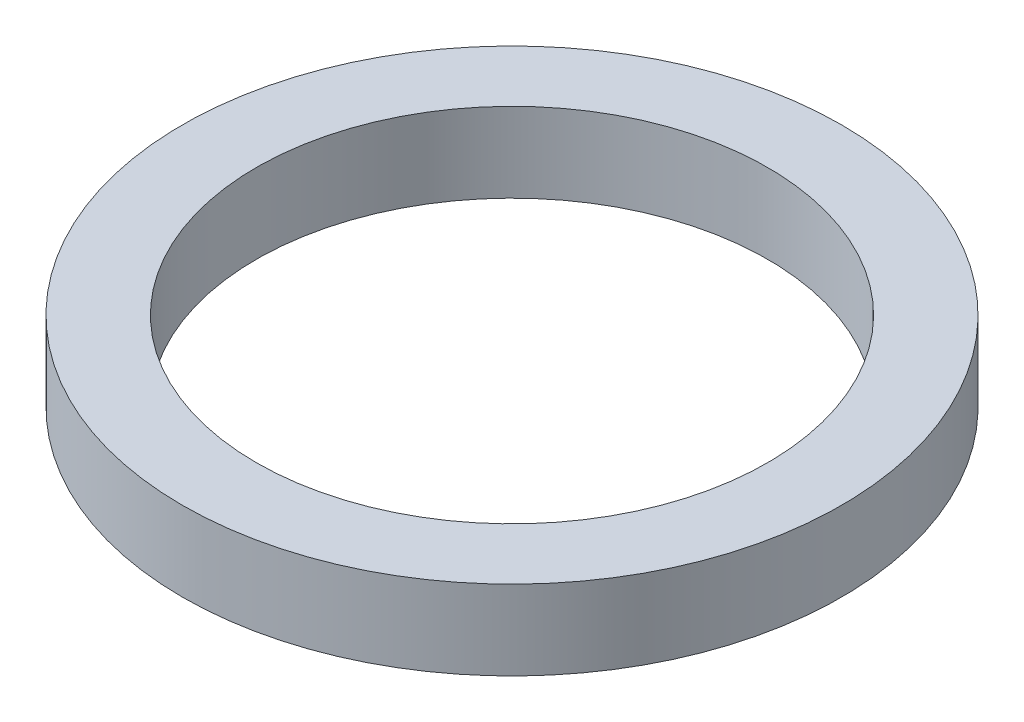
ISO-10303-21;
HEADER;
FILE_DESCRIPTION(('STEP AP214'),'2;1');
FILE_NAME('part.step','',(''),(''),'','','');
FILE_SCHEMA(('AUTOMOTIVE_DESIGN { 1 0 10303 214 1 1 1 1 }'));
ENDSEC;
DATA;
#1=APPLICATION_CONTEXT('core data for automotive mechanical design processes');
#2=APPLICATION_PROTOCOL_DEFINITION('international standard','automotive_design',2000,#1);
#3=PRODUCT_CONTEXT('',#1,'mechanical');
#4=PRODUCT('Part','Part','',(#3));
#5=PRODUCT_RELATED_PRODUCT_CATEGORY('part','',(#4));
#6=PRODUCT_DEFINITION_FORMATION('','',#4);
#7=PRODUCT_DEFINITION_CONTEXT('part definition',#1,'design');
#8=PRODUCT_DEFINITION('design','',#6,#7);
#9=PRODUCT_DEFINITION_SHAPE('','',#8);
#10=(LENGTH_UNIT() NAMED_UNIT(*) SI_UNIT(.MILLI.,.METRE.));
#11=(NAMED_UNIT(*) PLANE_ANGLE_UNIT() SI_UNIT($,.RADIAN.));
#12=(NAMED_UNIT(*) SI_UNIT($,.STERADIAN.) SOLID_ANGLE_UNIT());
#13=UNCERTAINTY_MEASURE_WITH_UNIT(LENGTH_MEASURE(1.E-05),#10,'distance_accuracy_value','');
#14=(GEOMETRIC_REPRESENTATION_CONTEXT(3) GLOBAL_UNCERTAINTY_ASSIGNED_CONTEXT((#13)) GLOBAL_UNIT_ASSIGNED_CONTEXT((#10,
#11,#12)) REPRESENTATION_CONTEXT('',''));
#15=CARTESIAN_POINT('',(0.,0.,0.));
#16=DIRECTION('',(0.,0.,1.));
#17=DIRECTION('',(1.,0.,0.));
#18=AXIS2_PLACEMENT_3D('',#15,#16,#17);
#19=CARTESIAN_POINT('',(0.,7.,0.));
#20=DIRECTION('',(0.,1.,0.));
#21=DIRECTION('',(0.,0.,1.));
#22=AXIS2_PLACEMENT_3D('',#19,#20,#21);
#23=PLANE('',#22);
#24=CARTESIAN_POINT('',(0.,7.,0.));
#25=DIRECTION('',(0.,1.,0.));
#26=DIRECTION('',(0.,0.,1.));
#27=AXIS2_PLACEMENT_3D('',#24,#25,#26);
#28=CIRCLE('',#27,29.);
#29=CARTESIAN_POINT('',(0.,7.,29.));
#30=VERTEX_POINT('',#29);
#31=EDGE_CURVE('E10',#30,#30,#28,.T.);
#32=ORIENTED_EDGE('',*,*,#31,.T.);
#33=EDGE_LOOP('',(#32));
#34=FACE_BOUND('',#33,.T.);
#35=CARTESIAN_POINT('',(0.,7.,0.));
#36=DIRECTION('',(0.,1.,0.));
#37=DIRECTION('',(0.,0.,1.));
#38=AXIS2_PLACEMENT_3D('',#35,#36,#37);
#39=CIRCLE('',#38,22.5);
#40=CARTESIAN_POINT('',(0.,7.,22.5));
#41=VERTEX_POINT('',#40);
#42=EDGE_CURVE('E42',#41,#41,#39,.T.);
#43=ORIENTED_EDGE('',*,*,#42,.F.);
#44=EDGE_LOOP('',(#43));
#45=FACE_BOUND('',#44,.T.);
#46=ADVANCED_FACE('F31',(#34,#45),#23,.T.);
#47=CARTESIAN_POINT('',(0.,0.,0.));
#48=DIRECTION('',(0.,1.,0.));
#49=DIRECTION('',(0.,0.,1.));
#50=AXIS2_PLACEMENT_3D('',#47,#48,#49);
#51=PLANE('',#50);
#52=CARTESIAN_POINT('',(0.,0.,0.));
#53=DIRECTION('',(0.,1.,0.));
#54=DIRECTION('',(0.,0.,1.));
#55=AXIS2_PLACEMENT_3D('',#52,#53,#54);
#56=CIRCLE('',#55,29.);
#57=CARTESIAN_POINT('',(0.,0.,29.));
#58=VERTEX_POINT('',#57);
#59=EDGE_CURVE('E35',#58,#58,#56,.T.);
#60=ORIENTED_EDGE('',*,*,#59,.F.);
#61=EDGE_LOOP('',(#60));
#62=FACE_BOUND('',#61,.T.);
#63=CARTESIAN_POINT('',(0.,0.,0.));
#64=DIRECTION('',(0.,1.,0.));
#65=DIRECTION('',(0.,0.,1.));
#66=AXIS2_PLACEMENT_3D('',#63,#64,#65);
#67=CIRCLE('',#66,22.5);
#68=CARTESIAN_POINT('',(0.,0.,22.5));
#69=VERTEX_POINT('',#68);
#70=EDGE_CURVE('E44',#69,#69,#67,.T.);
#71=ORIENTED_EDGE('',*,*,#70,.T.);
#72=EDGE_LOOP('',(#71));
#73=FACE_BOUND('',#72,.T.);
#74=ADVANCED_FACE('F54',(#62,#73),#51,.F.);
#75=CARTESIAN_POINT('',(0.,7.,0.));
#76=DIRECTION('',(0.,-1.,0.));
#77=DIRECTION('',(0.,0.,-1.));
#78=AXIS2_PLACEMENT_3D('',#75,#76,#77);
#79=CYLINDRICAL_SURFACE('',#78,29.);
#80=ORIENTED_EDGE('',*,*,#31,.F.);
#81=EDGE_LOOP('',(#80));
#82=FACE_BOUND('',#81,.T.);
#83=ORIENTED_EDGE('',*,*,#59,.T.);
#84=EDGE_LOOP('',(#83));
#85=FACE_BOUND('',#84,.T.);
#86=ADVANCED_FACE('F33',(#82,#85),#79,.T.);
#87=CARTESIAN_POINT('',(0.,7.,0.));
#88=DIRECTION('',(0.,-1.,0.));
#89=DIRECTION('',(0.,0.,-1.));
#90=AXIS2_PLACEMENT_3D('',#87,#88,#89);
#91=CYLINDRICAL_SURFACE('',#90,22.5);
#92=ORIENTED_EDGE('',*,*,#42,.T.);
#93=EDGE_LOOP('',(#92));
#94=FACE_BOUND('',#93,.T.);
#95=ORIENTED_EDGE('',*,*,#70,.F.);
#96=EDGE_LOOP('',(#95));
#97=FACE_BOUND('',#96,.T.);
#98=ADVANCED_FACE('F50',(#94,#97),#91,.F.);
#99=CLOSED_SHELL('',(#46,#74,#86,#98));
#100=MANIFOLD_SOLID_BREP('B2',#99);
#101=ADVANCED_BREP_SHAPE_REPRESENTATION('',(#18,#100),#14);
#102=SHAPE_DEFINITION_REPRESENTATION(#9,#101);
ENDSEC;
END-ISO-10303-21;
